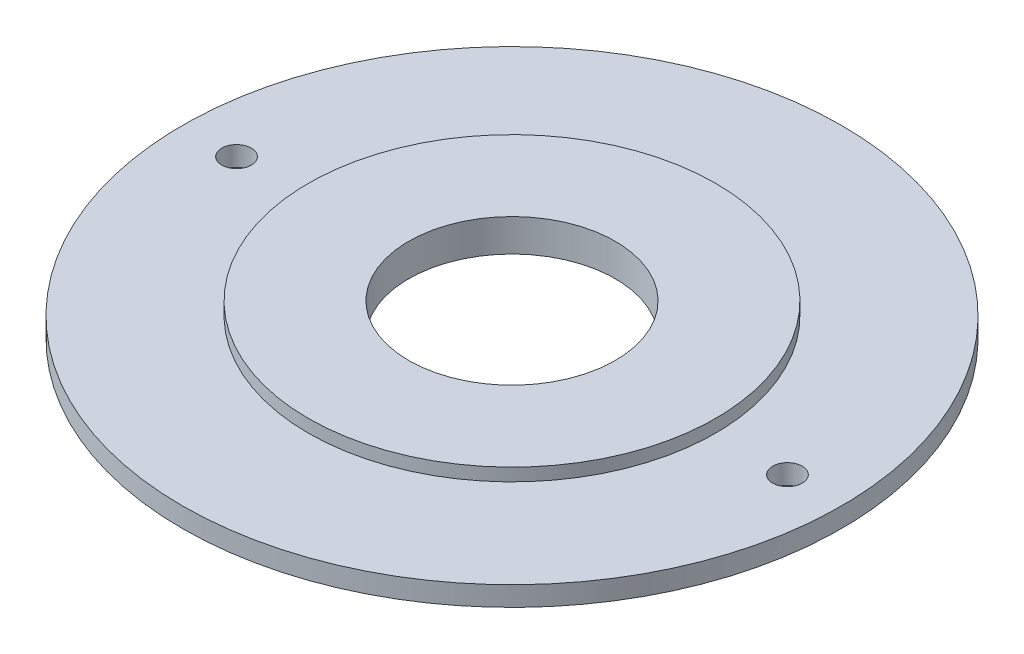
ISO-10303-21;
HEADER;
FILE_DESCRIPTION(('STEP AP214'),'2;1');
FILE_NAME('part.step','',(''),(''),'','','');
FILE_SCHEMA(('AUTOMOTIVE_DESIGN { 1 0 10303 214 1 1 1 1 }'));
ENDSEC;
DATA;
#1=APPLICATION_CONTEXT('core data for automotive mechanical design processes');
#2=APPLICATION_PROTOCOL_DEFINITION('international standard','automotive_design',2000,#1);
#3=PRODUCT_CONTEXT('',#1,'mechanical');
#4=PRODUCT('Part','Part','',(#3));
#5=PRODUCT_RELATED_PRODUCT_CATEGORY('part','',(#4));
#6=PRODUCT_DEFINITION_FORMATION('','',#4);
#7=PRODUCT_DEFINITION_CONTEXT('part definition',#1,'design');
#8=PRODUCT_DEFINITION('design','',#6,#7);
#9=PRODUCT_DEFINITION_SHAPE('','',#8);
#10=(LENGTH_UNIT() NAMED_UNIT(*) SI_UNIT(.MILLI.,.METRE.));
#11=(NAMED_UNIT(*) PLANE_ANGLE_UNIT() SI_UNIT($,.RADIAN.));
#12=(NAMED_UNIT(*) SI_UNIT($,.STERADIAN.) SOLID_ANGLE_UNIT());
#13=UNCERTAINTY_MEASURE_WITH_UNIT(LENGTH_MEASURE(1.E-05),#10,'distance_accuracy_value','');
#14=(GEOMETRIC_REPRESENTATION_CONTEXT(3) GLOBAL_UNCERTAINTY_ASSIGNED_CONTEXT((#13)) GLOBAL_UNIT_ASSIGNED_CONTEXT((#10,
#11,#12)) REPRESENTATION_CONTEXT('',''));
#15=CARTESIAN_POINT('',(0.,0.,0.));
#16=DIRECTION('',(0.,0.,1.));
#17=DIRECTION('',(1.,0.,0.));
#18=AXIS2_PLACEMENT_3D('',#15,#16,#17);
#19=CARTESIAN_POINT('',(0.,1.,0.));
#20=DIRECTION('',(0.,-1.,0.));
#21=DIRECTION('',(0.,0.,-1.));
#22=AXIS2_PLACEMENT_3D('',#19,#20,#21);
#23=CYLINDRICAL_SURFACE('',#22,16.75);
#24=CARTESIAN_POINT('',(0.,1.,0.));
#25=DIRECTION('',(0.,1.,0.));
#26=DIRECTION('',(0.,0.,1.));
#27=AXIS2_PLACEMENT_3D('',#24,#25,#26);
#28=CIRCLE('',#27,16.75);
#29=CARTESIAN_POINT('',(0.,1.,16.75));
#30=VERTEX_POINT('',#29);
#31=EDGE_CURVE('E39',#30,#30,#28,.T.);
#32=ORIENTED_EDGE('',*,*,#31,.F.);
#33=EDGE_LOOP('',(#32));
#34=FACE_BOUND('',#33,.T.);
#35=CARTESIAN_POINT('',(0.,0.,0.));
#36=DIRECTION('',(0.,1.,0.));
#37=DIRECTION('',(0.,0.,1.));
#38=AXIS2_PLACEMENT_3D('',#35,#36,#37);
#39=CIRCLE('',#38,16.75);
#40=CARTESIAN_POINT('',(0.,0.,16.75));
#41=VERTEX_POINT('',#40);
#42=EDGE_CURVE('E35',#41,#41,#39,.T.);
#43=ORIENTED_EDGE('',*,*,#42,.T.);
#44=EDGE_LOOP('',(#43));
#45=FACE_BOUND('',#44,.T.);
#46=ADVANCED_FACE('F32',(#34,#45),#23,.T.);
#47=CARTESIAN_POINT('',(0.,1.,0.));
#48=DIRECTION('',(0.,1.,0.));
#49=DIRECTION('',(0.,0.,1.));
#50=AXIS2_PLACEMENT_3D('',#47,#48,#49);
#51=PLANE('',#50);
#52=CARTESIAN_POINT('',(14.0000228,1.,0.));
#53=DIRECTION('',(0.,1.,0.));
#54=DIRECTION('',(0.,0.,1.));
#55=AXIS2_PLACEMENT_3D('',#52,#53,#54);
#56=CIRCLE('',#55,0.749998499999987);
#57=CARTESIAN_POINT('',(14.0000228,1.,0.749998499999987));
#58=VERTEX_POINT('',#57);
#59=EDGE_CURVE('E52',#58,#58,#56,.T.);
#60=ORIENTED_EDGE('',*,*,#59,.F.);
#61=EDGE_LOOP('',(#60));
#62=FACE_BOUND('',#61,.T.);
#63=CARTESIAN_POINT('',(-13.999972,1.,0.));
#64=DIRECTION('',(0.,1.,0.));
#65=DIRECTION('',(0.,0.,1.));
#66=AXIS2_PLACEMENT_3D('',#63,#64,#65);
#67=CIRCLE('',#66,0.749998499999987);
#68=CARTESIAN_POINT('',(-13.999972,1.,0.749998499999987));
#69=VERTEX_POINT('',#68);
#70=EDGE_CURVE('E57',#69,#69,#67,.T.);
#71=ORIENTED_EDGE('',*,*,#70,.F.);
#72=EDGE_LOOP('',(#71));
#73=FACE_BOUND('',#72,.T.);
#74=CARTESIAN_POINT('',(0.,1.,0.));
#75=DIRECTION('',(0.,1.,0.));
#76=DIRECTION('',(0.,0.,1.));
#77=AXIS2_PLACEMENT_3D('',#74,#75,#76);
#78=CIRCLE('',#77,10.35);
#79=CARTESIAN_POINT('',(0.,1.,10.35));
#80=VERTEX_POINT('',#79);
#81=EDGE_CURVE('E10',#80,#80,#78,.T.);
#82=ORIENTED_EDGE('',*,*,#81,.F.);
#83=EDGE_LOOP('',(#82));
#84=FACE_BOUND('',#83,.T.);
#85=ORIENTED_EDGE('',*,*,#31,.T.);
#86=EDGE_LOOP('',(#85));
#87=FACE_BOUND('',#86,.T.);
#88=ADVANCED_FACE('F73',(#62,#73,#84,#87),#51,.T.);
#89=CARTESIAN_POINT('',(0.,0.,0.));
#90=DIRECTION('',(0.,1.,0.));
#91=DIRECTION('',(0.,0.,1.));
#92=AXIS2_PLACEMENT_3D('',#89,#90,#91);
#93=PLANE('',#92);
#94=CARTESIAN_POINT('',(14.0000228,0.,0.));
#95=DIRECTION('',(0.,-1.,0.));
#96=DIRECTION('',(0.,0.,-1.));
#97=AXIS2_PLACEMENT_3D('',#94,#95,#96);
#98=CIRCLE('',#97,0.749998499999987);
#99=CARTESIAN_POINT('',(14.0000228,0.,-0.749998499999987));
#100=VERTEX_POINT('',#99);
#101=EDGE_CURVE('E60',#100,#100,#98,.T.);
#102=ORIENTED_EDGE('',*,*,#101,.F.);
#103=EDGE_LOOP('',(#102));
#104=FACE_BOUND('',#103,.T.);
#105=CARTESIAN_POINT('',(-13.999972,0.,0.));
#106=DIRECTION('',(0.,-1.,0.));
#107=DIRECTION('',(0.,0.,-1.));
#108=AXIS2_PLACEMENT_3D('',#105,#106,#107);
#109=CIRCLE('',#108,0.749998499999987);
#110=CARTESIAN_POINT('',(-13.999972,0.,-0.749998499999987));
#111=VERTEX_POINT('',#110);
#112=EDGE_CURVE('E61',#111,#111,#109,.T.);
#113=ORIENTED_EDGE('',*,*,#112,.F.);
#114=EDGE_LOOP('',(#113));
#115=FACE_BOUND('',#114,.T.);
#116=CARTESIAN_POINT('',(0.,0.,0.));
#117=DIRECTION('',(0.,1.,0.));
#118=DIRECTION('',(0.,0.,1.));
#119=AXIS2_PLACEMENT_3D('',#116,#117,#118);
#120=CIRCLE('',#119,5.25);
#121=CARTESIAN_POINT('',(0.,0.,5.25));
#122=VERTEX_POINT('',#121);
#123=EDGE_CURVE('E48',#122,#122,#120,.T.);
#124=ORIENTED_EDGE('',*,*,#123,.T.);
#125=EDGE_LOOP('',(#124));
#126=FACE_BOUND('',#125,.T.);
#127=ORIENTED_EDGE('',*,*,#42,.F.);
#128=EDGE_LOOP('',(#127));
#129=FACE_BOUND('',#128,.T.);
#130=ADVANCED_FACE('F69',(#104,#115,#126,#129),#93,.F.);
#131=CARTESIAN_POINT('',(0.,1.65,0.));
#132=DIRECTION('',(0.,-1.,0.));
#133=DIRECTION('',(0.,0.,-1.));
#134=AXIS2_PLACEMENT_3D('',#131,#132,#133);
#135=CYLINDRICAL_SURFACE('',#134,10.35);
#136=CARTESIAN_POINT('',(0.,1.65,0.));
#137=DIRECTION('',(0.,1.,0.));
#138=DIRECTION('',(0.,0.,1.));
#139=AXIS2_PLACEMENT_3D('',#136,#137,#138);
#140=CIRCLE('',#139,10.35);
#141=CARTESIAN_POINT('',(0.,1.65,10.35));
#142=VERTEX_POINT('',#141);
#143=EDGE_CURVE('E45',#142,#142,#140,.T.);
#144=ORIENTED_EDGE('',*,*,#143,.F.);
#145=EDGE_LOOP('',(#144));
#146=FACE_BOUND('',#145,.T.);
#147=ORIENTED_EDGE('',*,*,#81,.T.);
#148=EDGE_LOOP('',(#147));
#149=FACE_BOUND('',#148,.T.);
#150=ADVANCED_FACE('F72',(#146,#149),#135,.T.);
#151=CARTESIAN_POINT('',(0.,1.65,0.));
#152=DIRECTION('',(0.,1.,0.));
#153=DIRECTION('',(0.,0.,1.));
#154=AXIS2_PLACEMENT_3D('',#151,#152,#153);
#155=PLANE('',#154);
#156=CARTESIAN_POINT('',(0.,1.65,0.));
#157=DIRECTION('',(0.,1.,0.));
#158=DIRECTION('',(0.,0.,1.));
#159=AXIS2_PLACEMENT_3D('',#156,#157,#158);
#160=CIRCLE('',#159,5.25);
#161=CARTESIAN_POINT('',(0.,1.65,5.25));
#162=VERTEX_POINT('',#161);
#163=EDGE_CURVE('E49',#162,#162,#160,.T.);
#164=ORIENTED_EDGE('',*,*,#163,.F.);
#165=EDGE_LOOP('',(#164));
#166=FACE_BOUND('',#165,.T.);
#167=ORIENTED_EDGE('',*,*,#143,.T.);
#168=EDGE_LOOP('',(#167));
#169=FACE_BOUND('',#168,.T.);
#170=ADVANCED_FACE('F97',(#166,#169),#155,.T.);
#171=CARTESIAN_POINT('',(0.,0.,0.));
#172=DIRECTION('',(0.,1.,0.));
#173=DIRECTION('',(0.,0.,1.));
#174=AXIS2_PLACEMENT_3D('',#171,#172,#173);
#175=CYLINDRICAL_SURFACE('',#174,5.25);
#176=ORIENTED_EDGE('',*,*,#123,.F.);
#177=EDGE_LOOP('',(#176));
#178=FACE_BOUND('',#177,.T.);
#179=ORIENTED_EDGE('',*,*,#163,.T.);
#180=EDGE_LOOP('',(#179));
#181=FACE_BOUND('',#180,.T.);
#182=ADVANCED_FACE('F101',(#178,#181),#175,.F.);
#183=CARTESIAN_POINT('',(-13.999972,1.65,0.));
#184=DIRECTION('',(0.,-1.,0.));
#185=DIRECTION('',(0.,0.,-1.));
#186=AXIS2_PLACEMENT_3D('',#183,#184,#185);
#187=CYLINDRICAL_SURFACE('',#186,0.749998499999987);
#188=ORIENTED_EDGE('',*,*,#70,.T.);
#189=EDGE_LOOP('',(#188));
#190=FACE_BOUND('',#189,.T.);
#191=ORIENTED_EDGE('',*,*,#112,.T.);
#192=EDGE_LOOP('',(#191));
#193=FACE_BOUND('',#192,.T.);
#194=ADVANCED_FACE('F105',(#190,#193),#187,.F.);
#195=CARTESIAN_POINT('',(14.0000228,1.65,0.));
#196=DIRECTION('',(0.,-1.,0.));
#197=DIRECTION('',(0.,0.,-1.));
#198=AXIS2_PLACEMENT_3D('',#195,#196,#197);
#199=CYLINDRICAL_SURFACE('',#198,0.749998499999987);
#200=ORIENTED_EDGE('',*,*,#59,.T.);
#201=EDGE_LOOP('',(#200));
#202=FACE_BOUND('',#201,.T.);
#203=ORIENTED_EDGE('',*,*,#101,.T.);
#204=EDGE_LOOP('',(#203));
#205=FACE_BOUND('',#204,.T.);
#206=ADVANCED_FACE('F67',(#202,#205),#199,.F.);
#207=CLOSED_SHELL('',(#46,#88,#130,#150,#170,#182,#194,#206));
#208=MANIFOLD_SOLID_BREP('B2',#207);
#209=ADVANCED_BREP_SHAPE_REPRESENTATION('',(#18,#208),#14);
#210=SHAPE_DEFINITION_REPRESENTATION(#9,#209);
ENDSEC;
END-ISO-10303-21;
